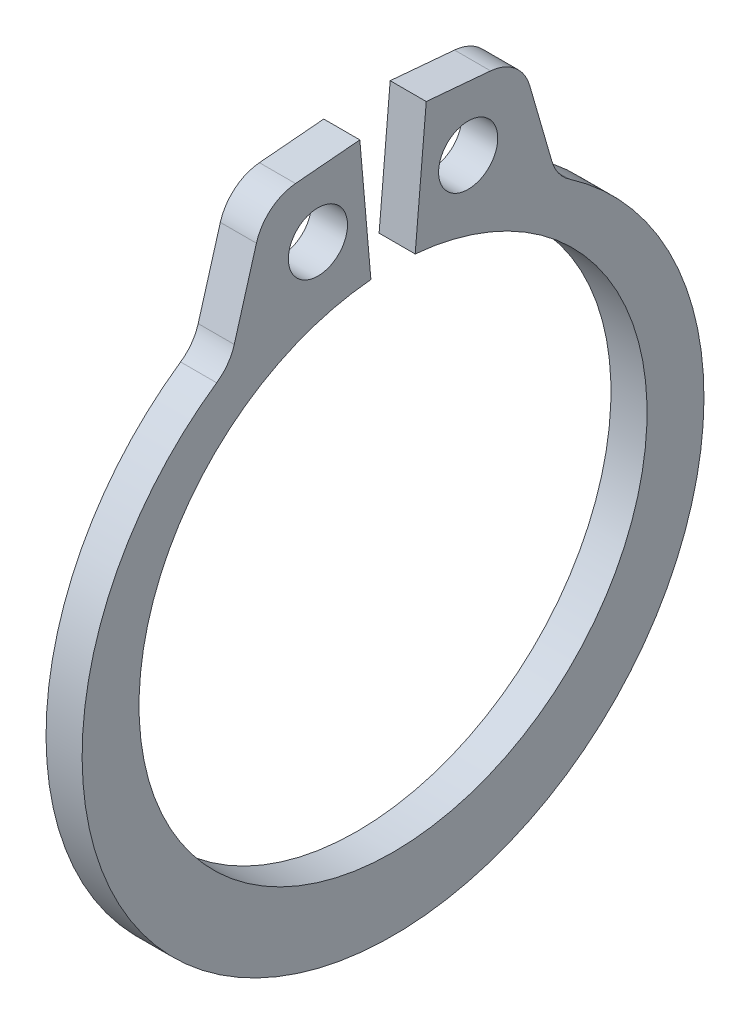
ISO-10303-21;
HEADER;
FILE_DESCRIPTION(('STEP AP214'),'2;1');
FILE_NAME('part.step','',(''),(''),'','','');
FILE_SCHEMA(('AUTOMOTIVE_DESIGN { 1 0 10303 214 1 1 1 1 }'));
ENDSEC;
DATA;
#1=APPLICATION_CONTEXT('core data for automotive mechanical design processes');
#2=APPLICATION_PROTOCOL_DEFINITION('international standard','automotive_design',2000,#1);
#3=PRODUCT_CONTEXT('',#1,'mechanical');
#4=PRODUCT('Part','Part','',(#3));
#5=PRODUCT_RELATED_PRODUCT_CATEGORY('part','',(#4));
#6=PRODUCT_DEFINITION_FORMATION('','',#4);
#7=PRODUCT_DEFINITION_CONTEXT('part definition',#1,'design');
#8=PRODUCT_DEFINITION('design','',#6,#7);
#9=PRODUCT_DEFINITION_SHAPE('','',#8);
#10=(LENGTH_UNIT() NAMED_UNIT(*) SI_UNIT(.MILLI.,.METRE.));
#11=(NAMED_UNIT(*) PLANE_ANGLE_UNIT() SI_UNIT($,.RADIAN.));
#12=(NAMED_UNIT(*) SI_UNIT($,.STERADIAN.) SOLID_ANGLE_UNIT());
#13=UNCERTAINTY_MEASURE_WITH_UNIT(LENGTH_MEASURE(1.E-05),#10,'distance_accuracy_value','');
#14=(GEOMETRIC_REPRESENTATION_CONTEXT(3) GLOBAL_UNCERTAINTY_ASSIGNED_CONTEXT((#13)) GLOBAL_UNIT_ASSIGNED_CONTEXT((#10,
#11,#12)) REPRESENTATION_CONTEXT('',''));
#15=CARTESIAN_POINT('',(0.,0.,0.));
#16=DIRECTION('',(0.,0.,1.));
#17=DIRECTION('',(1.,0.,0.));
#18=AXIS2_PLACEMENT_3D('',#15,#16,#17);
#19=CARTESIAN_POINT('',(0.3175,0.,0.));
#20=DIRECTION('',(1.,0.,0.));
#21=DIRECTION('',(0.,0.,-1.));
#22=AXIS2_PLACEMENT_3D('',#19,#20,#21);
#23=PLANE('',#22);
#24=CARTESIAN_POINT('',(0.3175,5.49368202936559,1.32203668641442));
#25=DIRECTION('',(1.,0.,0.));
#26=DIRECTION('',(0.,0.,-1.));
#27=AXIS2_PLACEMENT_3D('',#24,#25,#26);
#28=CIRCLE('',#27,0.5207);
#29=CARTESIAN_POINT('',(0.3175,5.49368202936559,0.801336686414417));
#30=VERTEX_POINT('',#29);
#31=EDGE_CURVE('E222',#30,#30,#28,.T.);
#32=ORIENTED_EDGE('',*,*,#31,.F.);
#33=EDGE_LOOP('',(#32));
#34=FACE_BOUND('',#33,.T.);
#35=DIRECTION('',(0.,-0.0871557427476583,0.996194698091745));
#36=VECTOR('',#35,1.);
#37=CARTESIAN_POINT('',(0.3175,6.68008316752401,0.584431548568699));
#38=LINE('',#37,#36);
#39=CARTESIAN_POINT('',(0.3175,6.68008316752401,0.584431548568699));
#40=VERTEX_POINT('',#39);
#41=CARTESIAN_POINT('',(0.3175,6.58102849769202,1.71663160558108));
#42=VERTEX_POINT('',#41);
#43=EDGE_CURVE('E134',#40,#42,#38,.T.);
#44=ORIENTED_EDGE('',*,*,#43,.T.);
#45=CARTESIAN_POINT('',(0.3175,5.79662479241458,1.64800517374158));
#46=DIRECTION('',(1.,0.,0.));
#47=DIRECTION('',(0.,0.,-1.));
#48=AXIS2_PLACEMENT_3D('',#45,#46,#47);
#49=CIRCLE('',#48,0.7874);
#50=CARTESIAN_POINT('',(0.3175,6.0153466835661,2.40441742531548));
#51=VERTEX_POINT('',#50);
#52=EDGE_CURVE('E175',#42,#51,#49,.T.);
#53=ORIENTED_EDGE('',*,*,#52,.T.);
#54=DIRECTION('',(0.,-0.96064548078982,0.277777357317143));
#55=VECTOR('',#54,1.);
#56=CARTESIAN_POINT('',(0.3175,6.53397528038183,2.2544523404497));
#57=LINE('',#56,#55);
#58=CARTESIAN_POINT('',(0.3175,4.66724971906374,2.79422908809335));
#59=VERTEX_POINT('',#58);
#60=EDGE_CURVE('E214',#51,#59,#57,.T.);
#61=ORIENTED_EDGE('',*,*,#60,.T.);
#62=CARTESIAN_POINT('',(0.3175,4.88597161021526,3.55064133966726));
#63=DIRECTION('',(1.,0.,0.));
#64=DIRECTION('',(0.,0.,-1.));
#65=AXIS2_PLACEMENT_3D('',#62,#63,#64);
#66=CIRCLE('',#65,0.7874);
#67=CARTESIAN_POINT('',(0.3175,4.23752329507568,3.10397195120119));
#68=VERTEX_POINT('',#67);
#69=EDGE_CURVE('E182',#59,#68,#66,.F.);
#70=ORIENTED_EDGE('',*,*,#69,.T.);
#71=CARTESIAN_POINT('',(0.3175,-0.268640399976462,0.));
#72=DIRECTION('',(1.,0.,0.));
#73=DIRECTION('',(0.,0.,-1.));
#74=AXIS2_PLACEMENT_3D('',#71,#72,#73);
#75=CIRCLE('',#74,5.47175960002354);
#76=CARTESIAN_POINT('',(0.3175,4.23752329507568,-3.10397195120119));
#77=VERTEX_POINT('',#76);
#78=EDGE_CURVE('E207',#68,#77,#75,.T.);
#79=ORIENTED_EDGE('',*,*,#78,.T.);
#80=CARTESIAN_POINT('',(0.3175,4.88597161021526,-3.55064133966726));
#81=DIRECTION('',(1.,0.,0.));
#82=DIRECTION('',(0.,0.,-1.));
#83=AXIS2_PLACEMENT_3D('',#80,#81,#82);
#84=CIRCLE('',#83,0.7874);
#85=CARTESIAN_POINT('',(0.3175,4.66724971906374,-2.79422908809335));
#86=VERTEX_POINT('',#85);
#87=EDGE_CURVE('E11',#77,#86,#84,.F.);
#88=ORIENTED_EDGE('',*,*,#87,.T.);
#89=DIRECTION('',(0.,0.96064548078982,0.277777357317143));
#90=VECTOR('',#89,1.);
#91=CARTESIAN_POINT('',(0.3175,6.53397528038183,-2.2544523404497));
#92=LINE('',#91,#90);
#93=CARTESIAN_POINT('',(0.3175,6.0153466835661,-2.40441742531548));
#94=VERTEX_POINT('',#93);
#95=EDGE_CURVE('E206',#86,#94,#92,.T.);
#96=ORIENTED_EDGE('',*,*,#95,.T.);
#97=CARTESIAN_POINT('',(0.3175,5.79662479241458,-1.64800517374158));
#98=DIRECTION('',(1.,0.,0.));
#99=DIRECTION('',(0.,0.,-1.));
#100=AXIS2_PLACEMENT_3D('',#97,#98,#99);
#101=CIRCLE('',#100,0.7874);
#102=CARTESIAN_POINT('',(0.3175,6.58102849769202,-1.71663160558108));
#103=VERTEX_POINT('',#102);
#104=EDGE_CURVE('E50',#94,#103,#101,.T.);
#105=ORIENTED_EDGE('',*,*,#104,.T.);
#106=DIRECTION('',(0.,0.0871557427476583,0.996194698091745));
#107=VECTOR('',#106,1.);
#108=CARTESIAN_POINT('',(0.3175,6.68008316752401,-0.584431548568699));
#109=LINE('',#108,#107);
#110=CARTESIAN_POINT('',(0.3175,6.68008316752401,-0.584431548568699));
#111=VERTEX_POINT('',#110);
#112=EDGE_CURVE('E211',#103,#111,#109,.T.);
#113=ORIENTED_EDGE('',*,*,#112,.T.);
#114=DIRECTION('',(0.,-0.996194698091745,0.0871557427476585));
#115=VECTOR('',#114,1.);
#116=CARTESIAN_POINT('',(0.3175,4.45338877834934,-0.389621032379132));
#117=LINE('',#116,#115);
#118=CARTESIAN_POINT('',(0.3175,4.45338877834934,-0.389621032379132));
#119=VERTEX_POINT('',#118);
#120=EDGE_CURVE('E140',#111,#119,#117,.T.);
#121=ORIENTED_EDGE('',*,*,#120,.T.);
#122=CARTESIAN_POINT('',(0.3175,0.,0.));
#123=DIRECTION('',(-1.,0.,0.));
#124=DIRECTION('',(0.,0.,-1.));
#125=AXIS2_PLACEMENT_3D('',#122,#123,#124);
#126=CIRCLE('',#125,4.4704);
#127=CARTESIAN_POINT('',(0.3175,4.45338877834934,0.389621032379132));
#128=VERTEX_POINT('',#127);
#129=EDGE_CURVE('E135',#119,#128,#126,.T.);
#130=ORIENTED_EDGE('',*,*,#129,.T.);
#131=DIRECTION('',(0.,0.996194698091745,0.0871557427476585));
#132=VECTOR('',#131,1.);
#133=CARTESIAN_POINT('',(0.3175,4.45338877834934,0.389621032379132));
#134=LINE('',#133,#132);
#135=EDGE_CURVE('E126',#128,#40,#134,.T.);
#136=ORIENTED_EDGE('',*,*,#135,.T.);
#137=EDGE_LOOP('',(#44,#53,#61,#70,#79,#88,#96,#105,#113,#121,#130,#136));
#138=FACE_BOUND('',#137,.T.);
#139=CARTESIAN_POINT('',(0.3175,5.49368202936559,-1.32203668641442));
#140=DIRECTION('',(1.,0.,0.));
#141=DIRECTION('',(0.,0.,-1.));
#142=AXIS2_PLACEMENT_3D('',#139,#140,#141);
#143=CIRCLE('',#142,0.5207);
#144=CARTESIAN_POINT('',(0.3175,5.49368202936559,-1.84273668641442));
#145=VERTEX_POINT('',#144);
#146=EDGE_CURVE('E248',#145,#145,#143,.T.);
#147=ORIENTED_EDGE('',*,*,#146,.F.);
#148=EDGE_LOOP('',(#147));
#149=FACE_BOUND('',#148,.T.);
#150=ADVANCED_FACE('F35',(#34,#138,#149),#23,.T.);
#151=CARTESIAN_POINT('',(-0.3175,0.,0.));
#152=DIRECTION('',(1.,0.,0.));
#153=DIRECTION('',(0.,0.,-1.));
#154=AXIS2_PLACEMENT_3D('',#151,#152,#153);
#155=PLANE('',#154);
#156=CARTESIAN_POINT('',(-0.3175,5.49368202936559,1.32203668641442));
#157=DIRECTION('',(1.,0.,0.));
#158=DIRECTION('',(0.,0.,-1.));
#159=AXIS2_PLACEMENT_3D('',#156,#157,#158);
#160=CIRCLE('',#159,0.5207);
#161=CARTESIAN_POINT('',(-0.3175,5.49368202936559,0.801336686414417));
#162=VERTEX_POINT('',#161);
#163=EDGE_CURVE('E245',#162,#162,#160,.T.);
#164=ORIENTED_EDGE('',*,*,#163,.T.);
#165=EDGE_LOOP('',(#164));
#166=FACE_BOUND('',#165,.T.);
#167=DIRECTION('',(0.,-0.96064548078982,0.277777357317143));
#168=VECTOR('',#167,1.);
#169=CARTESIAN_POINT('',(-0.3175,6.53397528038183,2.2544523404497));
#170=LINE('',#169,#168);
#171=CARTESIAN_POINT('',(-0.3175,6.0153466835661,2.40441742531548));
#172=VERTEX_POINT('',#171);
#173=CARTESIAN_POINT('',(-0.3175,4.66724971906374,2.79422908809335));
#174=VERTEX_POINT('',#173);
#175=EDGE_CURVE('E201',#172,#174,#170,.T.);
#176=ORIENTED_EDGE('',*,*,#175,.F.);
#177=CARTESIAN_POINT('',(-0.3175,5.79662479241458,1.64800517374158));
#178=DIRECTION('',(1.,0.,0.));
#179=DIRECTION('',(0.,0.,-1.));
#180=AXIS2_PLACEMENT_3D('',#177,#178,#179);
#181=CIRCLE('',#180,0.7874);
#182=CARTESIAN_POINT('',(-0.3175,6.58102849769202,1.71663160558108));
#183=VERTEX_POINT('',#182);
#184=EDGE_CURVE('E171',#172,#183,#181,.F.);
#185=ORIENTED_EDGE('',*,*,#184,.T.);
#186=DIRECTION('',(0.,-0.0871557427476583,0.996194698091745));
#187=VECTOR('',#186,1.);
#188=CARTESIAN_POINT('',(-0.3175,6.68008316752401,0.584431548568699));
#189=LINE('',#188,#187);
#190=CARTESIAN_POINT('',(-0.3175,6.68008316752401,0.584431548568699));
#191=VERTEX_POINT('',#190);
#192=EDGE_CURVE('E224',#191,#183,#189,.T.);
#193=ORIENTED_EDGE('',*,*,#192,.F.);
#194=DIRECTION('',(0.,0.996194698091745,0.0871557427476585));
#195=VECTOR('',#194,1.);
#196=CARTESIAN_POINT('',(-0.3175,4.45338877834934,0.389621032379132));
#197=LINE('',#196,#195);
#198=CARTESIAN_POINT('',(-0.3175,4.45338877834934,0.389621032379132));
#199=VERTEX_POINT('',#198);
#200=EDGE_CURVE('E221',#199,#191,#197,.T.);
#201=ORIENTED_EDGE('',*,*,#200,.F.);
#202=CARTESIAN_POINT('',(-0.3175,0.,0.));
#203=DIRECTION('',(-1.,0.,0.));
#204=DIRECTION('',(0.,0.,-1.));
#205=AXIS2_PLACEMENT_3D('',#202,#203,#204);
#206=CIRCLE('',#205,4.4704);
#207=CARTESIAN_POINT('',(-0.3175,4.45338877834934,-0.389621032379132));
#208=VERTEX_POINT('',#207);
#209=EDGE_CURVE('E148',#208,#199,#206,.T.);
#210=ORIENTED_EDGE('',*,*,#209,.F.);
#211=DIRECTION('',(0.,-0.996194698091745,0.0871557427476585));
#212=VECTOR('',#211,1.);
#213=CARTESIAN_POINT('',(-0.3175,4.45338877834934,-0.389621032379132));
#214=LINE('',#213,#212);
#215=CARTESIAN_POINT('',(-0.3175,6.68008316752401,-0.584431548568699));
#216=VERTEX_POINT('',#215);
#217=EDGE_CURVE('E144',#216,#208,#214,.T.);
#218=ORIENTED_EDGE('',*,*,#217,.F.);
#219=DIRECTION('',(0.,0.0871557427476583,0.996194698091745));
#220=VECTOR('',#219,1.);
#221=CARTESIAN_POINT('',(-0.3175,6.68008316752401,-0.584431548568699));
#222=LINE('',#221,#220);
#223=CARTESIAN_POINT('',(-0.3175,6.58102849769202,-1.71663160558108));
#224=VERTEX_POINT('',#223);
#225=EDGE_CURVE('E229',#224,#216,#222,.T.);
#226=ORIENTED_EDGE('',*,*,#225,.F.);
#227=CARTESIAN_POINT('',(-0.3175,5.79662479241458,-1.64800517374158));
#228=DIRECTION('',(1.,0.,0.));
#229=DIRECTION('',(0.,0.,-1.));
#230=AXIS2_PLACEMENT_3D('',#227,#228,#229);
#231=CIRCLE('',#230,0.7874);
#232=CARTESIAN_POINT('',(-0.3175,6.0153466835661,-2.40441742531548));
#233=VERTEX_POINT('',#232);
#234=EDGE_CURVE('E169',#224,#233,#231,.F.);
#235=ORIENTED_EDGE('',*,*,#234,.T.);
#236=DIRECTION('',(0.,0.96064548078982,0.277777357317143));
#237=VECTOR('',#236,1.);
#238=CARTESIAN_POINT('',(-0.3175,6.53397528038183,-2.2544523404497));
#239=LINE('',#238,#237);
#240=CARTESIAN_POINT('',(-0.3175,4.66724971906374,-2.79422908809335));
#241=VERTEX_POINT('',#240);
#242=EDGE_CURVE('E192',#241,#233,#239,.T.);
#243=ORIENTED_EDGE('',*,*,#242,.F.);
#244=CARTESIAN_POINT('',(-0.3175,4.88597161021526,-3.55064133966726));
#245=DIRECTION('',(1.,0.,0.));
#246=DIRECTION('',(0.,0.,-1.));
#247=AXIS2_PLACEMENT_3D('',#244,#245,#246);
#248=CIRCLE('',#247,0.7874);
#249=CARTESIAN_POINT('',(-0.3175,4.23752329507568,-3.10397195120119));
#250=VERTEX_POINT('',#249);
#251=EDGE_CURVE('E43',#241,#250,#248,.T.);
#252=ORIENTED_EDGE('',*,*,#251,.T.);
#253=CARTESIAN_POINT('',(-0.3175,-0.268640399976462,0.));
#254=DIRECTION('',(1.,0.,0.));
#255=DIRECTION('',(0.,0.,-1.));
#256=AXIS2_PLACEMENT_3D('',#253,#254,#255);
#257=CIRCLE('',#256,5.47175960002354);
#258=CARTESIAN_POINT('',(-0.3175,4.23752329507568,3.10397195120119));
#259=VERTEX_POINT('',#258);
#260=EDGE_CURVE('E190',#259,#250,#257,.T.);
#261=ORIENTED_EDGE('',*,*,#260,.F.);
#262=CARTESIAN_POINT('',(-0.3175,4.88597161021526,3.55064133966726));
#263=DIRECTION('',(1.,0.,0.));
#264=DIRECTION('',(0.,0.,-1.));
#265=AXIS2_PLACEMENT_3D('',#262,#263,#264);
#266=CIRCLE('',#265,0.7874);
#267=EDGE_CURVE('E180',#259,#174,#266,.T.);
#268=ORIENTED_EDGE('',*,*,#267,.T.);
#269=EDGE_LOOP('',(#176,#185,#193,#201,#210,#218,#226,#235,#243,#252,#261,#268));
#270=FACE_BOUND('',#269,.T.);
#271=CARTESIAN_POINT('',(-0.3175,5.49368202936559,-1.32203668641442));
#272=DIRECTION('',(1.,0.,0.));
#273=DIRECTION('',(0.,0.,-1.));
#274=AXIS2_PLACEMENT_3D('',#271,#272,#273);
#275=CIRCLE('',#274,0.5207);
#276=CARTESIAN_POINT('',(-0.3175,5.49368202936559,-1.84273668641442));
#277=VERTEX_POINT('',#276);
#278=EDGE_CURVE('E251',#277,#277,#275,.T.);
#279=ORIENTED_EDGE('',*,*,#278,.T.);
#280=EDGE_LOOP('',(#279));
#281=FACE_BOUND('',#280,.T.);
#282=ADVANCED_FACE('F188',(#166,#270,#281),#155,.F.);
#283=CARTESIAN_POINT('',(0.3175,0.,0.));
#284=DIRECTION('',(-1.,0.,0.));
#285=DIRECTION('',(0.,0.,1.));
#286=AXIS2_PLACEMENT_3D('',#283,#284,#285);
#287=CYLINDRICAL_SURFACE('',#286,4.4704);
#288=ORIENTED_EDGE('',*,*,#209,.T.);
#289=DIRECTION('',(-1.,0.,0.));
#290=VECTOR('',#289,1.);
#291=CARTESIAN_POINT('',(0.3175,4.45338877834934,0.389621032379132));
#292=LINE('',#291,#290);
#293=EDGE_CURVE('E130',#128,#199,#292,.T.);
#294=ORIENTED_EDGE('',*,*,#293,.F.);
#295=ORIENTED_EDGE('',*,*,#129,.F.);
#296=DIRECTION('',(-1.,0.,0.));
#297=VECTOR('',#296,1.);
#298=CARTESIAN_POINT('',(0.3175,4.45338877834934,-0.389621032379132));
#299=LINE('',#298,#297);
#300=EDGE_CURVE('E219',#119,#208,#299,.T.);
#301=ORIENTED_EDGE('',*,*,#300,.T.);
#302=EDGE_LOOP('',(#288,#294,#295,#301));
#303=FACE_BOUND('',#302,.T.);
#304=ADVANCED_FACE('F146',(#303),#287,.F.);
#305=CARTESIAN_POINT('',(0.3175,4.45338877834934,0.389621032379132));
#306=DIRECTION('',(0.,-0.0871557427476585,0.996194698091746));
#307=DIRECTION('',(0.,-0.996194698091746,-0.0871557427476585));
#308=AXIS2_PLACEMENT_3D('',#305,#306,#307);
#309=PLANE('',#308);
#310=ORIENTED_EDGE('',*,*,#200,.T.);
#311=DIRECTION('',(-1.,0.,0.));
#312=VECTOR('',#311,1.);
#313=CARTESIAN_POINT('',(0.3175,6.68008316752401,0.584431548568699));
#314=LINE('',#313,#312);
#315=EDGE_CURVE('E133',#40,#191,#314,.T.);
#316=ORIENTED_EDGE('',*,*,#315,.F.);
#317=ORIENTED_EDGE('',*,*,#135,.F.);
#318=ORIENTED_EDGE('',*,*,#293,.T.);
#319=EDGE_LOOP('',(#310,#316,#317,#318));
#320=FACE_BOUND('',#319,.T.);
#321=ADVANCED_FACE('F128',(#320),#309,.F.);
#322=CARTESIAN_POINT('',(0.3175,6.68008316752401,0.584431548568699));
#323=DIRECTION('',(0.,-0.996194698091746,-0.0871557427476583));
#324=DIRECTION('',(0.,0.0871557427476583,-0.996194698091746));
#325=AXIS2_PLACEMENT_3D('',#322,#323,#324);
#326=PLANE('',#325);
#327=ORIENTED_EDGE('',*,*,#192,.T.);
#328=DIRECTION('',(-1.,0.,0.));
#329=VECTOR('',#328,1.);
#330=CARTESIAN_POINT('',(0.3175,6.58102849769202,1.71663160558108));
#331=LINE('',#330,#329);
#332=EDGE_CURVE('E58',#183,#42,#331,.F.);
#333=ORIENTED_EDGE('',*,*,#332,.T.);
#334=ORIENTED_EDGE('',*,*,#43,.F.);
#335=ORIENTED_EDGE('',*,*,#315,.T.);
#336=EDGE_LOOP('',(#327,#333,#334,#335));
#337=FACE_BOUND('',#336,.T.);
#338=ADVANCED_FACE('F240',(#337),#326,.F.);
#339=CARTESIAN_POINT('',(0.3175,6.53397528038183,2.2544523404497));
#340=DIRECTION('',(0.,-0.277777357317143,-0.96064548078982));
#341=DIRECTION('',(0.,0.96064548078982,-0.277777357317143));
#342=AXIS2_PLACEMENT_3D('',#339,#340,#341);
#343=PLANE('',#342);
#344=ORIENTED_EDGE('',*,*,#175,.T.);
#345=DIRECTION('',(1.,0.,0.));
#346=VECTOR('',#345,1.);
#347=CARTESIAN_POINT('',(0.3175,4.66724971906374,2.79422908809335));
#348=LINE('',#347,#346);
#349=EDGE_CURVE('E162',#174,#59,#348,.T.);
#350=ORIENTED_EDGE('',*,*,#349,.T.);
#351=ORIENTED_EDGE('',*,*,#60,.F.);
#352=DIRECTION('',(-1.,0.,0.));
#353=VECTOR('',#352,1.);
#354=CARTESIAN_POINT('',(0.3175,6.0153466835661,2.40441742531548));
#355=LINE('',#354,#353);
#356=EDGE_CURVE('E159',#51,#172,#355,.T.);
#357=ORIENTED_EDGE('',*,*,#356,.T.);
#358=EDGE_LOOP('',(#344,#350,#351,#357));
#359=FACE_BOUND('',#358,.T.);
#360=ADVANCED_FACE('F281',(#359),#343,.F.);
#361=CARTESIAN_POINT('',(0.3175,-0.268640399976462,0.));
#362=DIRECTION('',(-1.,0.,0.));
#363=DIRECTION('',(0.,0.,1.));
#364=AXIS2_PLACEMENT_3D('',#361,#362,#363);
#365=CYLINDRICAL_SURFACE('',#364,5.47175960002354);
#366=ORIENTED_EDGE('',*,*,#78,.F.);
#367=DIRECTION('',(-1.,0.,0.));
#368=VECTOR('',#367,1.);
#369=CARTESIAN_POINT('',(0.3175,4.23752329507568,3.1039719512012));
#370=LINE('',#369,#368);
#371=EDGE_CURVE('E151',#68,#259,#370,.T.);
#372=ORIENTED_EDGE('',*,*,#371,.T.);
#373=ORIENTED_EDGE('',*,*,#260,.T.);
#374=DIRECTION('',(-1.,0.,0.));
#375=VECTOR('',#374,1.);
#376=CARTESIAN_POINT('',(0.3175,4.23752329507568,-3.1039719512012));
#377=LINE('',#376,#375);
#378=EDGE_CURVE('E149',#250,#77,#377,.F.);
#379=ORIENTED_EDGE('',*,*,#378,.T.);
#380=EDGE_LOOP('',(#366,#372,#373,#379));
#381=FACE_BOUND('',#380,.T.);
#382=ADVANCED_FACE('F198',(#381),#365,.T.);
#383=CARTESIAN_POINT('',(0.3175,6.53397528038183,-2.2544523404497));
#384=DIRECTION('',(0.,-0.277777357317143,0.96064548078982));
#385=DIRECTION('',(0.,-0.96064548078982,-0.277777357317143));
#386=AXIS2_PLACEMENT_3D('',#383,#384,#385);
#387=PLANE('',#386);
#388=ORIENTED_EDGE('',*,*,#95,.F.);
#389=DIRECTION('',(1.,0.,0.));
#390=VECTOR('',#389,1.);
#391=CARTESIAN_POINT('',(-0.3175,4.66724971906374,-2.79422908809335));
#392=LINE('',#391,#390);
#393=EDGE_CURVE('E166',#86,#241,#392,.F.);
#394=ORIENTED_EDGE('',*,*,#393,.T.);
#395=ORIENTED_EDGE('',*,*,#242,.T.);
#396=DIRECTION('',(-1.,0.,0.));
#397=VECTOR('',#396,1.);
#398=CARTESIAN_POINT('',(0.3175,6.0153466835661,-2.40441742531548));
#399=LINE('',#398,#397);
#400=EDGE_CURVE('E164',#233,#94,#399,.F.);
#401=ORIENTED_EDGE('',*,*,#400,.T.);
#402=EDGE_LOOP('',(#388,#394,#395,#401));
#403=FACE_BOUND('',#402,.T.);
#404=ADVANCED_FACE('F209',(#403),#387,.F.);
#405=CARTESIAN_POINT('',(0.3175,6.68008316752401,-0.584431548568699));
#406=DIRECTION('',(0.,-0.996194698091746,0.0871557427476583));
#407=DIRECTION('',(0.,-0.0871557427476583,-0.996194698091746));
#408=AXIS2_PLACEMENT_3D('',#405,#406,#407);
#409=PLANE('',#408);
#410=ORIENTED_EDGE('',*,*,#112,.F.);
#411=DIRECTION('',(-1.,0.,0.));
#412=VECTOR('',#411,1.);
#413=CARTESIAN_POINT('',(0.3175,6.58102849769202,-1.71663160558108));
#414=LINE('',#413,#412);
#415=EDGE_CURVE('E177',#103,#224,#414,.T.);
#416=ORIENTED_EDGE('',*,*,#415,.T.);
#417=ORIENTED_EDGE('',*,*,#225,.T.);
#418=DIRECTION('',(-1.,0.,0.));
#419=VECTOR('',#418,1.);
#420=CARTESIAN_POINT('',(0.3175,6.68008316752401,-0.584431548568699));
#421=LINE('',#420,#419);
#422=EDGE_CURVE('E153',#111,#216,#421,.T.);
#423=ORIENTED_EDGE('',*,*,#422,.F.);
#424=EDGE_LOOP('',(#410,#416,#417,#423));
#425=FACE_BOUND('',#424,.T.);
#426=ADVANCED_FACE('F274',(#425),#409,.F.);
#427=CARTESIAN_POINT('',(0.3175,4.45338877834934,-0.389621032379132));
#428=DIRECTION('',(0.,-0.0871557427476585,-0.996194698091746));
#429=DIRECTION('',(0.,0.996194698091746,-0.0871557427476585));
#430=AXIS2_PLACEMENT_3D('',#427,#428,#429);
#431=PLANE('',#430);
#432=ORIENTED_EDGE('',*,*,#217,.T.);
#433=ORIENTED_EDGE('',*,*,#300,.F.);
#434=ORIENTED_EDGE('',*,*,#120,.F.);
#435=ORIENTED_EDGE('',*,*,#422,.T.);
#436=EDGE_LOOP('',(#432,#433,#434,#435));
#437=FACE_BOUND('',#436,.T.);
#438=ADVANCED_FACE('F236',(#437),#431,.F.);
#439=CARTESIAN_POINT('',(0.3175,5.49368202936559,1.32203668641442));
#440=DIRECTION('',(-1.,0.,0.));
#441=DIRECTION('',(0.,0.,1.));
#442=AXIS2_PLACEMENT_3D('',#439,#440,#441);
#443=CYLINDRICAL_SURFACE('',#442,0.5207);
#444=ORIENTED_EDGE('',*,*,#31,.T.);
#445=EDGE_LOOP('',(#444));
#446=FACE_BOUND('',#445,.T.);
#447=ORIENTED_EDGE('',*,*,#163,.F.);
#448=EDGE_LOOP('',(#447));
#449=FACE_BOUND('',#448,.T.);
#450=ADVANCED_FACE('F269',(#446,#449),#443,.F.);
#451=CARTESIAN_POINT('',(0.3175,5.49368202936559,-1.32203668641442));
#452=DIRECTION('',(-1.,0.,0.));
#453=DIRECTION('',(0.,0.,1.));
#454=AXIS2_PLACEMENT_3D('',#451,#452,#453);
#455=CYLINDRICAL_SURFACE('',#454,0.5207);
#456=ORIENTED_EDGE('',*,*,#146,.T.);
#457=EDGE_LOOP('',(#456));
#458=FACE_BOUND('',#457,.T.);
#459=ORIENTED_EDGE('',*,*,#278,.F.);
#460=EDGE_LOOP('',(#459));
#461=FACE_BOUND('',#460,.T.);
#462=ADVANCED_FACE('F257',(#458,#461),#455,.F.);
#463=CARTESIAN_POINT('',(0.3175,4.88597161021526,3.55064133966726));
#464=DIRECTION('',(-1.,0.,0.));
#465=DIRECTION('',(0.,0.,1.));
#466=AXIS2_PLACEMENT_3D('',#463,#464,#465);
#467=CYLINDRICAL_SURFACE('',#466,0.7874);
#468=ORIENTED_EDGE('',*,*,#69,.F.);
#469=ORIENTED_EDGE('',*,*,#349,.F.);
#470=ORIENTED_EDGE('',*,*,#267,.F.);
#471=ORIENTED_EDGE('',*,*,#371,.F.);
#472=EDGE_LOOP('',(#468,#469,#470,#471));
#473=FACE_BOUND('',#472,.T.);
#474=ADVANCED_FACE('F291',(#473),#467,.F.);
#475=CARTESIAN_POINT('',(0.3175,4.88597161021526,-3.55064133966726));
#476=DIRECTION('',(-1.,0.,0.));
#477=DIRECTION('',(0.,0.,1.));
#478=AXIS2_PLACEMENT_3D('',#475,#476,#477);
#479=CYLINDRICAL_SURFACE('',#478,0.7874);
#480=ORIENTED_EDGE('',*,*,#87,.F.);
#481=ORIENTED_EDGE('',*,*,#378,.F.);
#482=ORIENTED_EDGE('',*,*,#251,.F.);
#483=ORIENTED_EDGE('',*,*,#393,.F.);
#484=EDGE_LOOP('',(#480,#481,#482,#483));
#485=FACE_BOUND('',#484,.T.);
#486=ADVANCED_FACE('F204',(#485),#479,.F.);
#487=CARTESIAN_POINT('',(0.3175,5.79662479241458,1.64800517374158));
#488=DIRECTION('',(-1.,0.,0.));
#489=DIRECTION('',(0.,0.,1.));
#490=AXIS2_PLACEMENT_3D('',#487,#488,#489);
#491=CYLINDRICAL_SURFACE('',#490,0.7874);
#492=ORIENTED_EDGE('',*,*,#52,.F.);
#493=ORIENTED_EDGE('',*,*,#332,.F.);
#494=ORIENTED_EDGE('',*,*,#184,.F.);
#495=ORIENTED_EDGE('',*,*,#356,.F.);
#496=EDGE_LOOP('',(#492,#493,#494,#495));
#497=FACE_BOUND('',#496,.T.);
#498=ADVANCED_FACE('F296',(#497),#491,.T.);
#499=CARTESIAN_POINT('',(0.3175,5.79662479241458,-1.64800517374158));
#500=DIRECTION('',(-1.,0.,0.));
#501=DIRECTION('',(0.,0.,1.));
#502=AXIS2_PLACEMENT_3D('',#499,#500,#501);
#503=CYLINDRICAL_SURFACE('',#502,0.7874);
#504=ORIENTED_EDGE('',*,*,#104,.F.);
#505=ORIENTED_EDGE('',*,*,#400,.F.);
#506=ORIENTED_EDGE('',*,*,#234,.F.);
#507=ORIENTED_EDGE('',*,*,#415,.F.);
#508=EDGE_LOOP('',(#504,#505,#506,#507));
#509=FACE_BOUND('',#508,.T.);
#510=ADVANCED_FACE('F37',(#509),#503,.T.);
#511=CLOSED_SHELL('',(#150,#282,#304,#321,#338,#360,#382,#404,#426,#438,#450,#462,#474,#486,
#498,#510));
#512=MANIFOLD_SOLID_BREP('B2',#511);
#513=ADVANCED_BREP_SHAPE_REPRESENTATION('',(#18,#512),#14);
#514=SHAPE_DEFINITION_REPRESENTATION(#9,#513);
ENDSEC;
END-ISO-10303-21;
